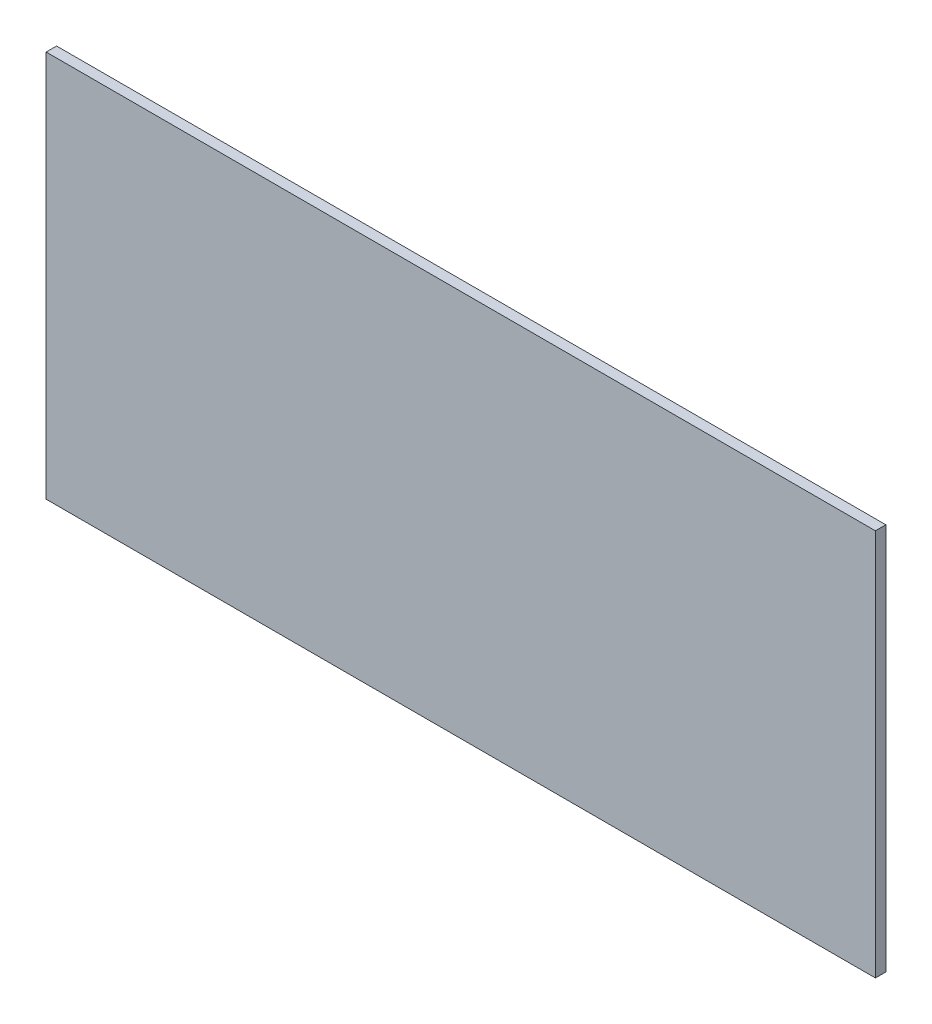
ISO-10303-21;
HEADER;
FILE_DESCRIPTION(('STEP AP214'),'2;1');
FILE_NAME('part.step','',(''),(''),'','','');
FILE_SCHEMA(('AUTOMOTIVE_DESIGN { 1 0 10303 214 1 1 1 1 }'));
ENDSEC;
DATA;
#1=APPLICATION_CONTEXT('core data for automotive mechanical design processes');
#2=APPLICATION_PROTOCOL_DEFINITION('international standard','automotive_design',2000,#1);
#3=PRODUCT_CONTEXT('',#1,'mechanical');
#4=PRODUCT('Part','Part','',(#3));
#5=PRODUCT_RELATED_PRODUCT_CATEGORY('part','',(#4));
#6=PRODUCT_DEFINITION_FORMATION('','',#4);
#7=PRODUCT_DEFINITION_CONTEXT('part definition',#1,'design');
#8=PRODUCT_DEFINITION('design','',#6,#7);
#9=PRODUCT_DEFINITION_SHAPE('','',#8);
#10=(LENGTH_UNIT() NAMED_UNIT(*) SI_UNIT(.MILLI.,.METRE.));
#11=(NAMED_UNIT(*) PLANE_ANGLE_UNIT() SI_UNIT($,.RADIAN.));
#12=(NAMED_UNIT(*) SI_UNIT($,.STERADIAN.) SOLID_ANGLE_UNIT());
#13=UNCERTAINTY_MEASURE_WITH_UNIT(LENGTH_MEASURE(1.E-05),#10,'distance_accuracy_value','');
#14=(GEOMETRIC_REPRESENTATION_CONTEXT(3) GLOBAL_UNCERTAINTY_ASSIGNED_CONTEXT((#13)) GLOBAL_UNIT_ASSIGNED_CONTEXT((#10,
#11,#12)) REPRESENTATION_CONTEXT('',''));
#15=CARTESIAN_POINT('',(0.,0.,0.));
#16=DIRECTION('',(0.,0.,1.));
#17=DIRECTION('',(1.,0.,0.));
#18=AXIS2_PLACEMENT_3D('',#15,#16,#17);
#19=CARTESIAN_POINT('',(-473.329414511639,454.025,-1056.71816018733));
#20=DIRECTION('',(-1.,0.,0.));
#21=DIRECTION('',(0.,0.,1.));
#22=AXIS2_PLACEMENT_3D('',#19,#20,#21);
#23=PLANE('',#22);
#24=DIRECTION('',(0.,-1.,0.));
#25=VECTOR('',#24,1.);
#26=CARTESIAN_POINT('',(-473.329414511639,454.025,-11.90625));
#27=LINE('',#26,#25);
#28=CARTESIAN_POINT('',(-473.329414511639,454.025,-11.9062500000005));
#29=VERTEX_POINT('',#28);
#30=CARTESIAN_POINT('',(-473.329414511639,11.90625,-11.90625));
#31=VERTEX_POINT('',#30);
#32=EDGE_CURVE('E102',#29,#31,#27,.T.);
#33=ORIENTED_EDGE('',*,*,#32,.T.);
#34=DIRECTION('',(0.,0.,1.));
#35=VECTOR('',#34,1.);
#36=CARTESIAN_POINT('',(-473.329414511639,11.90625,-1056.71816018733));
#37=LINE('',#36,#35);
#38=CARTESIAN_POINT('',(-473.329414511639,11.90625,0.));
#39=VERTEX_POINT('',#38);
#40=EDGE_CURVE('E36',#31,#39,#37,.T.);
#41=ORIENTED_EDGE('',*,*,#40,.T.);
#42=DIRECTION('',(0.,-1.,0.));
#43=VECTOR('',#42,1.);
#44=CARTESIAN_POINT('',(-473.329414511639,454.025,0.));
#45=LINE('',#44,#43);
#46=CARTESIAN_POINT('',(-473.329414511639,454.025,0.));
#47=VERTEX_POINT('',#46);
#48=EDGE_CURVE('E99',#47,#39,#45,.T.);
#49=ORIENTED_EDGE('',*,*,#48,.F.);
#50=DIRECTION('',(0.,0.,1.));
#51=VECTOR('',#50,1.);
#52=CARTESIAN_POINT('',(-473.329414511639,454.025,-1056.71816018733));
#53=LINE('',#52,#51);
#54=EDGE_CURVE('E84',#29,#47,#53,.T.);
#55=ORIENTED_EDGE('',*,*,#54,.F.);
#56=EDGE_LOOP('',(#33,#41,#49,#55));
#57=FACE_BOUND('',#56,.T.);
#58=ADVANCED_FACE('F32',(#57),#23,.T.);
#59=CARTESIAN_POINT('',(-473.329414511639,454.025,-1056.71816018733));
#60=DIRECTION('',(0.,1.,0.));
#61=DIRECTION('',(0.,0.,1.));
#62=AXIS2_PLACEMENT_3D('',#59,#60,#61);
#63=PLANE('',#62);
#64=DIRECTION('',(-1.,0.,0.));
#65=VECTOR('',#64,1.);
#66=CARTESIAN_POINT('',(-473.329414511639,454.025,-11.90625));
#67=LINE('',#66,#65);
#68=CARTESIAN_POINT('',(473.329414511649,454.025,-11.9062500000005));
#69=VERTEX_POINT('',#68);
#70=EDGE_CURVE('E71',#69,#29,#67,.T.);
#71=ORIENTED_EDGE('',*,*,#70,.T.);
#72=ORIENTED_EDGE('',*,*,#54,.T.);
#73=DIRECTION('',(-1.,0.,0.));
#74=VECTOR('',#73,1.);
#75=CARTESIAN_POINT('',(-473.329414511639,454.025,0.));
#76=LINE('',#75,#74);
#77=CARTESIAN_POINT('',(473.329414511649,454.025,0.));
#78=VERTEX_POINT('',#77);
#79=EDGE_CURVE('E90',#78,#47,#76,.T.);
#80=ORIENTED_EDGE('',*,*,#79,.F.);
#81=DIRECTION('',(0.,0.,1.));
#82=VECTOR('',#81,1.);
#83=CARTESIAN_POINT('',(473.329414511649,454.025,-1056.71816018733));
#84=LINE('',#83,#82);
#85=EDGE_CURVE('E78',#69,#78,#84,.T.);
#86=ORIENTED_EDGE('',*,*,#85,.F.);
#87=EDGE_LOOP('',(#71,#72,#80,#86));
#88=FACE_BOUND('',#87,.T.);
#89=ADVANCED_FACE('F93',(#88),#63,.T.);
#90=CARTESIAN_POINT('',(473.329414511649,454.025,-1056.71816018733));
#91=DIRECTION('',(1.,0.,0.));
#92=DIRECTION('',(0.,1.,0.));
#93=AXIS2_PLACEMENT_3D('',#90,#91,#92);
#94=PLANE('',#93);
#95=DIRECTION('',(0.,-1.,0.));
#96=VECTOR('',#95,1.);
#97=CARTESIAN_POINT('',(473.329414511649,454.025,-11.90625));
#98=LINE('',#97,#96);
#99=CARTESIAN_POINT('',(473.329414511649,11.90625,-11.9062500000005));
#100=VERTEX_POINT('',#99);
#101=EDGE_CURVE('E11',#69,#100,#98,.T.);
#102=ORIENTED_EDGE('',*,*,#101,.F.);
#103=ORIENTED_EDGE('',*,*,#85,.T.);
#104=DIRECTION('',(0.,1.,0.));
#105=VECTOR('',#104,1.);
#106=CARTESIAN_POINT('',(473.329414511649,454.025,0.));
#107=LINE('',#106,#105);
#108=CARTESIAN_POINT('',(473.329414511649,11.90625,0.));
#109=VERTEX_POINT('',#108);
#110=EDGE_CURVE('E81',#109,#78,#107,.T.);
#111=ORIENTED_EDGE('',*,*,#110,.F.);
#112=DIRECTION('',(0.,0.,1.));
#113=VECTOR('',#112,1.);
#114=CARTESIAN_POINT('',(473.329414511649,11.90625,-1056.71816018733));
#115=LINE('',#114,#113);
#116=EDGE_CURVE('E54',#100,#109,#115,.T.);
#117=ORIENTED_EDGE('',*,*,#116,.F.);
#118=EDGE_LOOP('',(#102,#103,#111,#117));
#119=FACE_BOUND('',#118,.T.);
#120=ADVANCED_FACE('F80',(#119),#94,.T.);
#121=CARTESIAN_POINT('',(-473.329414511639,11.90625,-1056.71816018733));
#122=DIRECTION('',(0.,-1.,0.));
#123=DIRECTION('',(0.,0.,-1.));
#124=AXIS2_PLACEMENT_3D('',#121,#122,#123);
#125=PLANE('',#124);
#126=DIRECTION('',(-1.,0.,0.));
#127=VECTOR('',#126,1.);
#128=CARTESIAN_POINT('',(-473.329414511639,11.90625,-11.90625));
#129=LINE('',#128,#127);
#130=EDGE_CURVE('E41',#100,#31,#129,.T.);
#131=ORIENTED_EDGE('',*,*,#130,.F.);
#132=ORIENTED_EDGE('',*,*,#116,.T.);
#133=DIRECTION('',(1.,0.,0.));
#134=VECTOR('',#133,1.);
#135=CARTESIAN_POINT('',(-473.329414511639,11.90625,0.));
#136=LINE('',#135,#134);
#137=EDGE_CURVE('E91',#39,#109,#136,.T.);
#138=ORIENTED_EDGE('',*,*,#137,.F.);
#139=ORIENTED_EDGE('',*,*,#40,.F.);
#140=EDGE_LOOP('',(#131,#132,#138,#139));
#141=FACE_BOUND('',#140,.T.);
#142=ADVANCED_FACE('F106',(#141),#125,.T.);
#143=CARTESIAN_POINT('',(0.,0.,0.));
#144=DIRECTION('',(0.,0.,1.));
#145=DIRECTION('',(1.,0.,0.));
#146=AXIS2_PLACEMENT_3D('',#143,#144,#145);
#147=PLANE('',#146);
#148=ORIENTED_EDGE('',*,*,#48,.T.);
#149=ORIENTED_EDGE('',*,*,#137,.T.);
#150=ORIENTED_EDGE('',*,*,#110,.T.);
#151=ORIENTED_EDGE('',*,*,#79,.T.);
#152=EDGE_LOOP('',(#148,#149,#150,#151));
#153=FACE_BOUND('',#152,.T.);
#154=ADVANCED_FACE('F89',(#153),#147,.T.);
#155=CARTESIAN_POINT('',(-473.329414511639,454.025,-11.90625));
#156=DIRECTION('',(0.,0.,1.));
#157=DIRECTION('',(1.,0.,0.));
#158=AXIS2_PLACEMENT_3D('',#155,#156,#157);
#159=PLANE('',#158);
#160=ORIENTED_EDGE('',*,*,#130,.T.);
#161=ORIENTED_EDGE('',*,*,#32,.F.);
#162=ORIENTED_EDGE('',*,*,#70,.F.);
#163=ORIENTED_EDGE('',*,*,#101,.T.);
#164=EDGE_LOOP('',(#160,#161,#162,#163));
#165=FACE_BOUND('',#164,.T.);
#166=ADVANCED_FACE('F34',(#165),#159,.F.);
#167=CLOSED_SHELL('',(#58,#89,#120,#142,#154,#166));
#168=MANIFOLD_SOLID_BREP('B2',#167);
#169=ADVANCED_BREP_SHAPE_REPRESENTATION('',(#18,#168),#14);
#170=SHAPE_DEFINITION_REPRESENTATION(#9,#169);
ENDSEC;
END-ISO-10303-21;
